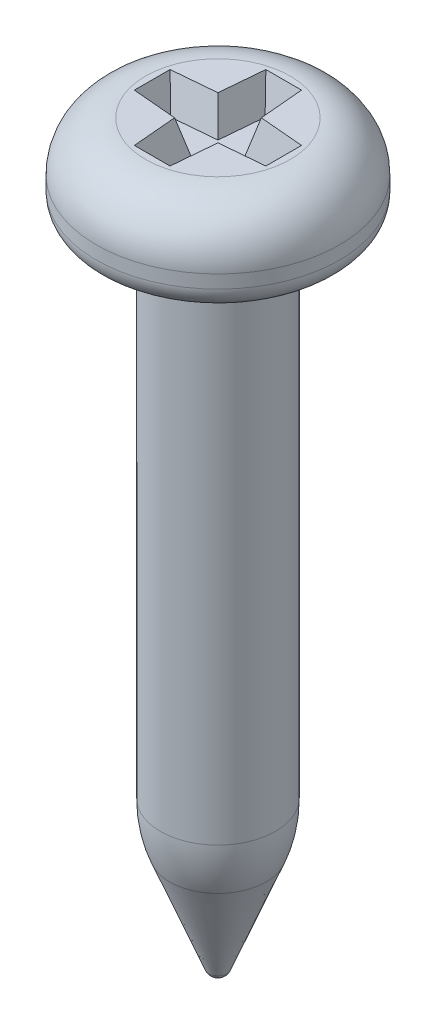
ISO-10303-21;
HEADER;
FILE_DESCRIPTION(('STEP AP214'),'2;1');
FILE_NAME('part.step','',(''),(''),'','','');
FILE_SCHEMA(('AUTOMOTIVE_DESIGN { 1 0 10303 214 1 1 1 1 }'));
ENDSEC;
DATA;
#1=APPLICATION_CONTEXT('core data for automotive mechanical design processes');
#2=APPLICATION_PROTOCOL_DEFINITION('international standard','automotive_design',2000,#1);
#3=PRODUCT_CONTEXT('',#1,'mechanical');
#4=PRODUCT('Part','Part','',(#3));
#5=PRODUCT_RELATED_PRODUCT_CATEGORY('part','',(#4));
#6=PRODUCT_DEFINITION_FORMATION('','',#4);
#7=PRODUCT_DEFINITION_CONTEXT('part definition',#1,'design');
#8=PRODUCT_DEFINITION('design','',#6,#7);
#9=PRODUCT_DEFINITION_SHAPE('','',#8);
#10=(LENGTH_UNIT() NAMED_UNIT(*) SI_UNIT(.MILLI.,.METRE.));
#11=(NAMED_UNIT(*) PLANE_ANGLE_UNIT() SI_UNIT($,.RADIAN.));
#12=(NAMED_UNIT(*) SI_UNIT($,.STERADIAN.) SOLID_ANGLE_UNIT());
#13=UNCERTAINTY_MEASURE_WITH_UNIT(LENGTH_MEASURE(1.E-05),#10,'distance_accuracy_value','');
#14=(GEOMETRIC_REPRESENTATION_CONTEXT(3) GLOBAL_UNCERTAINTY_ASSIGNED_CONTEXT((#13)) GLOBAL_UNIT_ASSIGNED_CONTEXT((#10,
#11,#12)) REPRESENTATION_CONTEXT('',''));
#15=CARTESIAN_POINT('',(0.,0.,0.));
#16=DIRECTION('',(0.,0.,1.));
#17=DIRECTION('',(1.,0.,0.));
#18=AXIS2_PLACEMENT_3D('',#15,#16,#17);
#19=CARTESIAN_POINT('',(1.1,0.,0.));
#20=DIRECTION('',(0.,-1.,0.));
#21=DIRECTION('',(1.,0.,0.));
#22=AXIS2_PLACEMENT_3D('',#19,#20,#21);
#23=PLANE('',#22);
#24=DIRECTION('',(-1.,0.,0.));
#25=VECTOR('',#24,1.);
#26=CARTESIAN_POINT('',(-0.271382595437633,0.,-1.));
#27=LINE('',#26,#25);
#28=CARTESIAN_POINT('',(0.271382595437633,0.,-1.));
#29=VERTEX_POINT('',#28);
#30=CARTESIAN_POINT('',(-0.271382595437633,0.,-1.));
#31=VERTEX_POINT('',#30);
#32=EDGE_CURVE('E139',#29,#31,#27,.T.);
#33=ORIENTED_EDGE('',*,*,#32,.F.);
#34=DIRECTION('',(-0.0871557427476548,0.,-0.996194698091746));
#35=VECTOR('',#34,1.);
#36=CARTESIAN_POINT('',(0.271382595437633,0.,-1.));
#37=LINE('',#36,#35);
#38=CARTESIAN_POINT('',(0.33,0.,-0.33));
#39=VERTEX_POINT('',#38);
#40=EDGE_CURVE('E47',#39,#29,#37,.T.);
#41=ORIENTED_EDGE('',*,*,#40,.F.);
#42=DIRECTION('',(-0.996194698091746,0.,-0.0871557427476548));
#43=VECTOR('',#42,1.);
#44=CARTESIAN_POINT('',(0.33,0.,-0.33));
#45=LINE('',#44,#43);
#46=CARTESIAN_POINT('',(1.,0.,-0.271382595437633));
#47=VERTEX_POINT('',#46);
#48=EDGE_CURVE('E171',#47,#39,#45,.T.);
#49=ORIENTED_EDGE('',*,*,#48,.F.);
#50=DIRECTION('',(0.,0.,-1.));
#51=VECTOR('',#50,1.);
#52=CARTESIAN_POINT('',(1.,0.,-0.271382595437633));
#53=LINE('',#52,#51);
#54=CARTESIAN_POINT('',(1.,0.,0.271382595437633));
#55=VERTEX_POINT('',#54);
#56=EDGE_CURVE('E169',#55,#47,#53,.T.);
#57=ORIENTED_EDGE('',*,*,#56,.F.);
#58=DIRECTION('',(0.996194698091746,0.,-0.0871557427476548));
#59=VECTOR('',#58,1.);
#60=CARTESIAN_POINT('',(0.33,0.,0.33));
#61=LINE('',#60,#59);
#62=CARTESIAN_POINT('',(0.33,0.,0.33));
#63=VERTEX_POINT('',#62);
#64=EDGE_CURVE('E166',#63,#55,#61,.T.);
#65=ORIENTED_EDGE('',*,*,#64,.F.);
#66=DIRECTION('',(0.0871557427476548,0.,-0.996194698091746));
#67=VECTOR('',#66,1.);
#68=CARTESIAN_POINT('',(0.271382595437633,0.,1.));
#69=LINE('',#68,#67);
#70=CARTESIAN_POINT('',(0.271382595437633,0.,1.));
#71=VERTEX_POINT('',#70);
#72=EDGE_CURVE('E163',#71,#63,#69,.T.);
#73=ORIENTED_EDGE('',*,*,#72,.F.);
#74=DIRECTION('',(1.,0.,0.));
#75=VECTOR('',#74,1.);
#76=CARTESIAN_POINT('',(-0.271382595437633,0.,1.));
#77=LINE('',#76,#75);
#78=CARTESIAN_POINT('',(-0.271382595437633,0.,1.));
#79=VERTEX_POINT('',#78);
#80=EDGE_CURVE('E160',#79,#71,#77,.T.);
#81=ORIENTED_EDGE('',*,*,#80,.F.);
#82=DIRECTION('',(0.0871557427476548,0.,0.996194698091746));
#83=VECTOR('',#82,1.);
#84=CARTESIAN_POINT('',(-0.271382595437633,0.,1.));
#85=LINE('',#84,#83);
#86=CARTESIAN_POINT('',(-0.33,0.,0.33));
#87=VERTEX_POINT('',#86);
#88=EDGE_CURVE('E157',#87,#79,#85,.T.);
#89=ORIENTED_EDGE('',*,*,#88,.F.);
#90=DIRECTION('',(0.996194698091746,0.,0.0871557427476548));
#91=VECTOR('',#90,1.);
#92=CARTESIAN_POINT('',(-0.33,0.,0.33));
#93=LINE('',#92,#91);
#94=CARTESIAN_POINT('',(-1.,0.,0.271382595437633));
#95=VERTEX_POINT('',#94);
#96=EDGE_CURVE('E154',#95,#87,#93,.T.);
#97=ORIENTED_EDGE('',*,*,#96,.F.);
#98=DIRECTION('',(0.,0.,1.));
#99=VECTOR('',#98,1.);
#100=CARTESIAN_POINT('',(-1.,0.,-0.271382595437633));
#101=LINE('',#100,#99);
#102=CARTESIAN_POINT('',(-1.,0.,-0.271382595437633));
#103=VERTEX_POINT('',#102);
#104=EDGE_CURVE('E148',#103,#95,#101,.T.);
#105=ORIENTED_EDGE('',*,*,#104,.F.);
#106=DIRECTION('',(-0.996194698091746,0.,0.0871557427476548));
#107=VECTOR('',#106,1.);
#108=CARTESIAN_POINT('',(-0.33,0.,-0.33));
#109=LINE('',#108,#107);
#110=CARTESIAN_POINT('',(-0.33,0.,-0.33));
#111=VERTEX_POINT('',#110);
#112=EDGE_CURVE('E146',#111,#103,#109,.T.);
#113=ORIENTED_EDGE('',*,*,#112,.F.);
#114=DIRECTION('',(-0.0871557427476548,0.,0.996194698091746));
#115=VECTOR('',#114,1.);
#116=CARTESIAN_POINT('',(-0.271382595437633,0.,-1.));
#117=LINE('',#116,#115);
#118=EDGE_CURVE('E130',#31,#111,#117,.T.);
#119=ORIENTED_EDGE('',*,*,#118,.F.);
#120=EDGE_LOOP('',(#33,#41,#49,#57,#65,#73,#81,#89,#97,#105,#113,#119));
#121=FACE_BOUND('',#120,.T.);
#122=CARTESIAN_POINT('',(0.,0.,0.));
#123=DIRECTION('',(0.,1.,0.));
#124=DIRECTION('',(-1.,0.,0.));
#125=AXIS2_PLACEMENT_3D('',#122,#123,#124);
#126=CIRCLE('',#125,1.1);
#127=CARTESIAN_POINT('',(-1.1,0.,0.));
#128=VERTEX_POINT('',#127);
#129=EDGE_CURVE('E11',#128,#128,#126,.T.);
#130=ORIENTED_EDGE('',*,*,#129,.T.);
#131=EDGE_LOOP('',(#130));
#132=FACE_BOUND('',#131,.T.);
#133=ADVANCED_FACE('F33',(#121,#132),#23,.F.);
#134=CARTESIAN_POINT('',(0.,-0.75,0.));
#135=DIRECTION('',(0.,1.,0.));
#136=DIRECTION('',(-1.,0.,0.));
#137=AXIS2_PLACEMENT_3D('',#134,#135,#136);
#138=TOROIDAL_SURFACE('',#137,1.1,0.75);
#139=ORIENTED_EDGE('',*,*,#129,.F.);
#140=EDGE_LOOP('',(#139));
#141=FACE_BOUND('',#140,.T.);
#142=CARTESIAN_POINT('',(0.,-0.75,0.));
#143=DIRECTION('',(0.,1.,0.));
#144=DIRECTION('',(-1.,0.,0.));
#145=AXIS2_PLACEMENT_3D('',#142,#143,#144);
#146=CIRCLE('',#145,1.85);
#147=CARTESIAN_POINT('',(-1.85,-0.75,0.));
#148=VERTEX_POINT('',#147);
#149=EDGE_CURVE('E40',#148,#148,#146,.T.);
#150=ORIENTED_EDGE('',*,*,#149,.T.);
#151=EDGE_LOOP('',(#150));
#152=FACE_BOUND('',#151,.T.);
#153=ADVANCED_FACE('F247',(#141,#152),#138,.T.);
#154=CARTESIAN_POINT('',(0.,0.,0.));
#155=DIRECTION('',(0.,1.,0.));
#156=DIRECTION('',(-1.,0.,0.));
#157=AXIS2_PLACEMENT_3D('',#154,#155,#156);
#158=CYLINDRICAL_SURFACE('',#157,1.85);
#159=ORIENTED_EDGE('',*,*,#149,.F.);
#160=EDGE_LOOP('',(#159));
#161=FACE_BOUND('',#160,.T.);
#162=CARTESIAN_POINT('',(0.,-0.95,0.));
#163=DIRECTION('',(0.,1.,0.));
#164=DIRECTION('',(-1.,0.,0.));
#165=AXIS2_PLACEMENT_3D('',#162,#163,#164);
#166=CIRCLE('',#165,1.85);
#167=CARTESIAN_POINT('',(-1.85,-0.95,0.));
#168=VERTEX_POINT('',#167);
#169=EDGE_CURVE('E242',#168,#168,#166,.T.);
#170=ORIENTED_EDGE('',*,*,#169,.T.);
#171=EDGE_LOOP('',(#170));
#172=FACE_BOUND('',#171,.T.);
#173=ADVANCED_FACE('F249',(#161,#172),#158,.T.);
#174=CARTESIAN_POINT('',(0.,-0.95,0.));
#175=DIRECTION('',(0.,1.,0.));
#176=DIRECTION('',(-1.,0.,0.));
#177=AXIS2_PLACEMENT_3D('',#174,#175,#176);
#178=TOROIDAL_SURFACE('',#177,1.5,0.35);
#179=ORIENTED_EDGE('',*,*,#169,.F.);
#180=EDGE_LOOP('',(#179));
#181=FACE_BOUND('',#180,.T.);
#182=CARTESIAN_POINT('',(0.,-1.3,0.));
#183=DIRECTION('',(0.,1.,0.));
#184=DIRECTION('',(-1.,0.,0.));
#185=AXIS2_PLACEMENT_3D('',#182,#183,#184);
#186=CIRCLE('',#185,1.5);
#187=CARTESIAN_POINT('',(-1.5,-1.3,0.));
#188=VERTEX_POINT('',#187);
#189=EDGE_CURVE('E239',#188,#188,#186,.T.);
#190=ORIENTED_EDGE('',*,*,#189,.T.);
#191=EDGE_LOOP('',(#190));
#192=FACE_BOUND('',#191,.T.);
#193=ADVANCED_FACE('F252',(#181,#192),#178,.T.);
#194=CARTESIAN_POINT('',(1.025,-1.3,0.));
#195=DIRECTION('',(0.,1.,0.));
#196=DIRECTION('',(-1.,0.,0.));
#197=AXIS2_PLACEMENT_3D('',#194,#195,#196);
#198=PLANE('',#197);
#199=ORIENTED_EDGE('',*,*,#189,.F.);
#200=EDGE_LOOP('',(#199));
#201=FACE_BOUND('',#200,.T.);
#202=CARTESIAN_POINT('',(0.,-1.3,0.));
#203=DIRECTION('',(0.,1.,0.));
#204=DIRECTION('',(-1.,0.,0.));
#205=AXIS2_PLACEMENT_3D('',#202,#203,#204);
#206=CIRCLE('',#205,1.025);
#207=CARTESIAN_POINT('',(-1.025,-1.3,0.));
#208=VERTEX_POINT('',#207);
#209=EDGE_CURVE('E236',#208,#208,#206,.T.);
#210=ORIENTED_EDGE('',*,*,#209,.T.);
#211=EDGE_LOOP('',(#210));
#212=FACE_BOUND('',#211,.T.);
#213=ADVANCED_FACE('F258',(#201,#212),#198,.F.);
#214=CARTESIAN_POINT('',(0.,-1.45,0.));
#215=DIRECTION('',(0.,1.,0.));
#216=DIRECTION('',(-1.,0.,0.));
#217=AXIS2_PLACEMENT_3D('',#214,#215,#216);
#218=TOROIDAL_SURFACE('',#217,1.025,0.15);
#219=ORIENTED_EDGE('',*,*,#209,.F.);
#220=EDGE_LOOP('',(#219));
#221=FACE_BOUND('',#220,.T.);
#222=CARTESIAN_POINT('',(0.,-1.45,0.));
#223=DIRECTION('',(0.,1.,0.));
#224=DIRECTION('',(-1.,0.,0.));
#225=AXIS2_PLACEMENT_3D('',#222,#223,#224);
#226=CIRCLE('',#225,0.875);
#227=CARTESIAN_POINT('',(-0.874999999999999,-1.45,0.));
#228=VERTEX_POINT('',#227);
#229=EDGE_CURVE('E233',#228,#228,#226,.T.);
#230=ORIENTED_EDGE('',*,*,#229,.T.);
#231=EDGE_LOOP('',(#230));
#232=FACE_BOUND('',#231,.T.);
#233=ADVANCED_FACE('F264',(#221,#232),#218,.F.);
#234=CARTESIAN_POINT('',(0.,0.,0.));
#235=DIRECTION('',(0.,1.,0.));
#236=DIRECTION('',(-1.,0.,0.));
#237=AXIS2_PLACEMENT_3D('',#234,#235,#236);
#238=CYLINDRICAL_SURFACE('',#237,0.875);
#239=ORIENTED_EDGE('',*,*,#229,.F.);
#240=EDGE_LOOP('',(#239));
#241=FACE_BOUND('',#240,.T.);
#242=CARTESIAN_POINT('',(0.,-8.96440542344636,0.));
#243=DIRECTION('',(0.,1.,0.));
#244=DIRECTION('',(-1.,0.,0.));
#245=AXIS2_PLACEMENT_3D('',#242,#243,#244);
#246=CIRCLE('',#245,0.875);
#247=CARTESIAN_POINT('',(-0.874999999999999,-8.96440542344636,0.));
#248=VERTEX_POINT('',#247);
#249=EDGE_CURVE('E230',#248,#248,#246,.T.);
#250=ORIENTED_EDGE('',*,*,#249,.T.);
#251=EDGE_LOOP('',(#250));
#252=FACE_BOUND('',#251,.T.);
#253=ADVANCED_FACE('F270',(#241,#252),#238,.T.);
#254=CARTESIAN_POINT('',(0.,-8.96440542344636,0.));
#255=DIRECTION('',(0.,1.,0.));
#256=DIRECTION('',(-1.,0.,0.));
#257=AXIS2_PLACEMENT_3D('',#254,#255,#256);
#258=DEGENERATE_TOROIDAL_SURFACE('',#257,1.125,2.,.F.);
#259=ORIENTED_EDGE('',*,*,#249,.F.);
#260=EDGE_LOOP('',(#259));
#261=FACE_BOUND('',#260,.T.);
#262=CARTESIAN_POINT('',(0.,-9.7,0.));
#263=DIRECTION('',(0.,1.,0.));
#264=DIRECTION('',(-1.,0.,0.));
#265=AXIS2_PLACEMENT_3D('',#262,#263,#264);
#266=CIRCLE('',#265,0.73481198483741);
#267=CARTESIAN_POINT('',(-0.734811984837409,-9.7,0.));
#268=VERTEX_POINT('',#267);
#269=EDGE_CURVE('E227',#268,#268,#266,.T.);
#270=ORIENTED_EDGE('',*,*,#269,.T.);
#271=EDGE_LOOP('',(#270));
#272=FACE_BOUND('',#271,.T.);
#273=ADVANCED_FACE('F276',(#261,#272),#258,.F.);
#274=CARTESIAN_POINT('',(0.,-11.2051695932415,0.));
#275=DIRECTION('',(0.,1.,0.));
#276=DIRECTION('',(-1.,0.,0.));
#277=AXIS2_PLACEMENT_3D('',#274,#275,#276);
#278=CONICAL_SURFACE('',#277,0.139485898862805,0.376639161138822);
#279=ORIENTED_EDGE('',*,*,#269,.F.);
#280=EDGE_LOOP('',(#279));
#281=FACE_BOUND('',#280,.T.);
#282=CARTESIAN_POINT('',(0.,-11.2051695932415,0.));
#283=DIRECTION('',(0.,1.,0.));
#284=DIRECTION('',(-1.,0.,0.));
#285=AXIS2_PLACEMENT_3D('',#282,#283,#284);
#286=CIRCLE('',#285,0.139485898862805);
#287=CARTESIAN_POINT('',(-0.139485898862804,-11.2051695932415,0.));
#288=VERTEX_POINT('',#287);
#289=EDGE_CURVE('E175',#288,#288,#286,.T.);
#290=ORIENTED_EDGE('',*,*,#289,.T.);
#291=EDGE_LOOP('',(#290));
#292=FACE_BOUND('',#291,.T.);
#293=ADVANCED_FACE('F282',(#281,#292),#278,.T.);
#294=CARTESIAN_POINT('',(0.,-11.15,0.));
#295=DIRECTION('',(0.,1.,0.));
#296=DIRECTION('',(-1.,0.,0.));
#297=AXIS2_PLACEMENT_3D('',#294,#295,#296);
#298=SPHERICAL_SURFACE('',#297,0.149999999999999);
#299=ORIENTED_EDGE('',*,*,#289,.F.);
#300=EDGE_LOOP('',(#299));
#301=FACE_BOUND('',#300,.T.);
#302=ADVANCED_FACE('F288',(#301),#298,.T.);
#303=CARTESIAN_POINT('',(0.271382595437633,0.,-1.));
#304=DIRECTION('',(0.962250186899058,-0.258819045102521,-0.0841859828293659));
#305=DIRECTION('',(0.259741110692871,0.965678287741851,0.));
#306=AXIS2_PLACEMENT_3D('',#303,#304,#305);
#307=PLANE('',#306);
#308=ORIENTED_EDGE('',*,*,#40,.T.);
#309=DIRECTION('',(0.230762906723662,0.939855498552101,-0.251833521838986));
#310=VECTOR('',#309,1.);
#311=CARTESIAN_POINT('',(0.271382595437633,0.,-1.));
#312=LINE('',#311,#310);
#313=CARTESIAN_POINT('',(0.148617496398917,-0.5,-0.866025403784438));
#314=VERTEX_POINT('',#313);
#315=EDGE_CURVE('E90',#314,#29,#312,.T.);
#316=ORIENTED_EDGE('',*,*,#315,.F.);
#317=DIRECTION('',(-0.0871557427476548,0.,-0.996194698091746));
#318=VECTOR('',#317,1.);
#319=CARTESIAN_POINT('',(0.222680446133132,-0.5,-0.0194820146255435));
#320=LINE('',#319,#318);
#321=CARTESIAN_POINT('',(0.206333094846248,-0.5,-0.206333094846248));
#322=VERTEX_POINT('',#321);
#323=EDGE_CURVE('E173',#322,#314,#320,.T.);
#324=ORIENTED_EDGE('',*,*,#323,.F.);
#325=DIRECTION('',(0.233463888260859,0.943922256203466,-0.233463888260859));
#326=VECTOR('',#325,1.);
#327=CARTESIAN_POINT('',(0.363323645043907,0.134731458681192,-0.363323645043907));
#328=LINE('',#327,#326);
#329=EDGE_CURVE('E55',#322,#39,#328,.T.);
#330=ORIENTED_EDGE('',*,*,#329,.T.);
#331=EDGE_LOOP('',(#308,#316,#324,#330));
#332=FACE_BOUND('',#331,.T.);
#333=ADVANCED_FACE('F293',(#332),#307,.F.);
#334=CARTESIAN_POINT('',(0.33,0.,-0.33));
#335=DIRECTION('',(0.0841859828293659,-0.258819045102521,-0.962250186899058));
#336=DIRECTION('',(0.,0.965678287741851,-0.259741110692871));
#337=AXIS2_PLACEMENT_3D('',#334,#335,#336);
#338=PLANE('',#337);
#339=ORIENTED_EDGE('',*,*,#48,.T.);
#340=ORIENTED_EDGE('',*,*,#329,.F.);
#341=DIRECTION('',(-0.996194698091746,0.,-0.0871557427476548));
#342=VECTOR('',#341,1.);
#343=CARTESIAN_POINT('',(0.0194820146255435,-0.5,-0.222680446133132));
#344=LINE('',#343,#342);
#345=CARTESIAN_POINT('',(0.866025403784438,-0.5,-0.148617496398917));
#346=VERTEX_POINT('',#345);
#347=EDGE_CURVE('E176',#346,#322,#344,.T.);
#348=ORIENTED_EDGE('',*,*,#347,.F.);
#349=DIRECTION('',(0.251833521838986,0.939855498552101,-0.230762906723662));
#350=VECTOR('',#349,1.);
#351=CARTESIAN_POINT('',(1.,0.,-0.271382595437633));
#352=LINE('',#351,#350);
#353=EDGE_CURVE('E95',#346,#47,#352,.T.);
#354=ORIENTED_EDGE('',*,*,#353,.T.);
#355=EDGE_LOOP('',(#339,#340,#348,#354));
#356=FACE_BOUND('',#355,.T.);
#357=ADVANCED_FACE('F298',(#356),#338,.F.);
#358=CARTESIAN_POINT('',(1.,0.,-0.271382595437633));
#359=DIRECTION('',(0.965925826289068,-0.258819045102521,0.));
#360=DIRECTION('',(0.258819045102521,0.965925826289068,0.));
#361=AXIS2_PLACEMENT_3D('',#358,#359,#360);
#362=PLANE('',#361);
#363=ORIENTED_EDGE('',*,*,#56,.T.);
#364=ORIENTED_EDGE('',*,*,#353,.F.);
#365=DIRECTION('',(0.,0.,-1.));
#366=VECTOR('',#365,1.);
#367=CARTESIAN_POINT('',(0.866025403784438,-0.5,0.));
#368=LINE('',#367,#366);
#369=CARTESIAN_POINT('',(0.866025403784438,-0.5,0.148617496398917));
#370=VERTEX_POINT('',#369);
#371=EDGE_CURVE('E199',#370,#346,#368,.T.);
#372=ORIENTED_EDGE('',*,*,#371,.F.);
#373=DIRECTION('',(0.251833521838986,0.939855498552101,0.230762906723662));
#374=VECTOR('',#373,1.);
#375=CARTESIAN_POINT('',(0.960914999983138,-0.145867205876761,0.23556779148571));
#376=LINE('',#375,#374);
#377=EDGE_CURVE('E191',#370,#55,#376,.T.);
#378=ORIENTED_EDGE('',*,*,#377,.T.);
#379=EDGE_LOOP('',(#363,#364,#372,#378));
#380=FACE_BOUND('',#379,.T.);
#381=ADVANCED_FACE('F360',(#380),#362,.F.);
#382=CARTESIAN_POINT('',(0.33,0.,0.33));
#383=DIRECTION('',(0.0841859828293659,-0.258819045102521,0.962250186899058));
#384=DIRECTION('',(0.,-0.965678287741851,-0.259741110692871));
#385=AXIS2_PLACEMENT_3D('',#382,#383,#384);
#386=PLANE('',#385);
#387=ORIENTED_EDGE('',*,*,#64,.T.);
#388=ORIENTED_EDGE('',*,*,#377,.F.);
#389=DIRECTION('',(0.996194698091746,0.,-0.0871557427476548));
#390=VECTOR('',#389,1.);
#391=CARTESIAN_POINT('',(0.0194820146255435,-0.5,0.222680446133132));
#392=LINE('',#391,#390);
#393=CARTESIAN_POINT('',(0.206333094846248,-0.5,0.206333094846248));
#394=VERTEX_POINT('',#393);
#395=EDGE_CURVE('E202',#394,#370,#392,.T.);
#396=ORIENTED_EDGE('',*,*,#395,.F.);
#397=DIRECTION('',(0.233463888260859,0.943922256203466,0.233463888260859));
#398=VECTOR('',#397,1.);
#399=CARTESIAN_POINT('',(0.33,0.,0.33));
#400=LINE('',#399,#398);
#401=EDGE_CURVE('E189',#394,#63,#400,.T.);
#402=ORIENTED_EDGE('',*,*,#401,.T.);
#403=EDGE_LOOP('',(#387,#388,#396,#402));
#404=FACE_BOUND('',#403,.T.);
#405=ADVANCED_FACE('F368',(#404),#386,.F.);
#406=CARTESIAN_POINT('',(0.271382595437633,0.,1.));
#407=DIRECTION('',(0.962250186899058,-0.258819045102521,0.0841859828293659));
#408=DIRECTION('',(0.259741110692871,0.965678287741851,0.));
#409=AXIS2_PLACEMENT_3D('',#406,#407,#408);
#410=PLANE('',#409);
#411=ORIENTED_EDGE('',*,*,#72,.T.);
#412=ORIENTED_EDGE('',*,*,#401,.F.);
#413=DIRECTION('',(0.0871557427476548,0.,-0.996194698091746));
#414=VECTOR('',#413,1.);
#415=CARTESIAN_POINT('',(0.222680446133132,-0.5,0.0194820146255435));
#416=LINE('',#415,#414);
#417=CARTESIAN_POINT('',(0.148617496398917,-0.5,0.866025403784438));
#418=VERTEX_POINT('',#417);
#419=EDGE_CURVE('E205',#418,#394,#416,.T.);
#420=ORIENTED_EDGE('',*,*,#419,.F.);
#421=DIRECTION('',(0.230762906723662,0.939855498552101,0.251833521838986));
#422=VECTOR('',#421,1.);
#423=CARTESIAN_POINT('',(0.242479524498311,-0.117716969910997,0.968457832976909));
#424=LINE('',#423,#422);
#425=EDGE_CURVE('E187',#418,#71,#424,.T.);
#426=ORIENTED_EDGE('',*,*,#425,.T.);
#427=EDGE_LOOP('',(#411,#412,#420,#426));
#428=FACE_BOUND('',#427,.T.);
#429=ADVANCED_FACE('F378',(#428),#410,.F.);
#430=CARTESIAN_POINT('',(-0.271382595437633,0.,1.));
#431=DIRECTION('',(0.,-0.258819045102521,0.965925826289068));
#432=DIRECTION('',(0.,-0.965925826289068,-0.258819045102521));
#433=AXIS2_PLACEMENT_3D('',#430,#431,#432);
#434=PLANE('',#433);
#435=ORIENTED_EDGE('',*,*,#80,.T.);
#436=ORIENTED_EDGE('',*,*,#425,.F.);
#437=DIRECTION('',(1.,0.,0.));
#438=VECTOR('',#437,1.);
#439=CARTESIAN_POINT('',(0.,-0.5,0.866025403784438));
#440=LINE('',#439,#438);
#441=CARTESIAN_POINT('',(-0.148617496398917,-0.5,0.866025403784438));
#442=VERTEX_POINT('',#441);
#443=EDGE_CURVE('E208',#442,#418,#440,.T.);
#444=ORIENTED_EDGE('',*,*,#443,.F.);
#445=DIRECTION('',(-0.230762906723662,0.939855498552101,0.251833521838986));
#446=VECTOR('',#445,1.);
#447=CARTESIAN_POINT('',(-0.271382595437633,0.,1.));
#448=LINE('',#447,#446);
#449=EDGE_CURVE('E185',#442,#79,#448,.T.);
#450=ORIENTED_EDGE('',*,*,#449,.T.);
#451=EDGE_LOOP('',(#435,#436,#444,#450));
#452=FACE_BOUND('',#451,.T.);
#453=ADVANCED_FACE('F388',(#452),#434,.F.);
#454=CARTESIAN_POINT('',(-0.271382595437633,0.,1.));
#455=DIRECTION('',(-0.962250186899058,-0.258819045102521,0.0841859828293659));
#456=DIRECTION('',(0.259741110692871,-0.965678287741851,0.));
#457=AXIS2_PLACEMENT_3D('',#454,#455,#456);
#458=PLANE('',#457);
#459=ORIENTED_EDGE('',*,*,#88,.T.);
#460=ORIENTED_EDGE('',*,*,#449,.F.);
#461=DIRECTION('',(0.0871557427476548,0.,0.996194698091746));
#462=VECTOR('',#461,1.);
#463=CARTESIAN_POINT('',(-0.222680446133132,-0.5,0.0194820146255435));
#464=LINE('',#463,#462);
#465=CARTESIAN_POINT('',(-0.206333094846248,-0.5,0.206333094846248));
#466=VERTEX_POINT('',#465);
#467=EDGE_CURVE('E211',#466,#442,#464,.T.);
#468=ORIENTED_EDGE('',*,*,#467,.F.);
#469=DIRECTION('',(-0.23346388826086,0.943922256203466,0.233463888260859));
#470=VECTOR('',#469,1.);
#471=CARTESIAN_POINT('',(-0.363323645043907,0.134731458681192,0.363323645043907));
#472=LINE('',#471,#470);
#473=EDGE_CURVE('E183',#466,#87,#472,.T.);
#474=ORIENTED_EDGE('',*,*,#473,.T.);
#475=EDGE_LOOP('',(#459,#460,#468,#474));
#476=FACE_BOUND('',#475,.T.);
#477=ADVANCED_FACE('F398',(#476),#458,.F.);
#478=CARTESIAN_POINT('',(-0.33,0.,0.33));
#479=DIRECTION('',(-0.0841859828293659,-0.258819045102521,0.962250186899058));
#480=DIRECTION('',(0.,-0.965678287741851,-0.259741110692871));
#481=AXIS2_PLACEMENT_3D('',#478,#479,#480);
#482=PLANE('',#481);
#483=ORIENTED_EDGE('',*,*,#96,.T.);
#484=ORIENTED_EDGE('',*,*,#473,.F.);
#485=DIRECTION('',(0.996194698091746,0.,0.0871557427476548));
#486=VECTOR('',#485,1.);
#487=CARTESIAN_POINT('',(-0.0194820146255434,-0.5,0.222680446133132));
#488=LINE('',#487,#486);
#489=CARTESIAN_POINT('',(-0.866025403784438,-0.5,0.148617496398917));
#490=VERTEX_POINT('',#489);
#491=EDGE_CURVE('E214',#490,#466,#488,.T.);
#492=ORIENTED_EDGE('',*,*,#491,.F.);
#493=DIRECTION('',(-0.251833521838987,0.939855498552101,0.230762906723662));
#494=VECTOR('',#493,1.);
#495=CARTESIAN_POINT('',(-0.968457832976909,-0.117716969910997,0.242479524498311));
#496=LINE('',#495,#494);
#497=EDGE_CURVE('E181',#490,#95,#496,.T.);
#498=ORIENTED_EDGE('',*,*,#497,.T.);
#499=EDGE_LOOP('',(#483,#484,#492,#498));
#500=FACE_BOUND('',#499,.T.);
#501=ADVANCED_FACE('F408',(#500),#482,.F.);
#502=CARTESIAN_POINT('',(-1.,0.,-0.271382595437633));
#503=DIRECTION('',(-0.965925826289068,-0.258819045102521,0.));
#504=DIRECTION('',(0.258819045102522,-0.965925826289068,0.));
#505=AXIS2_PLACEMENT_3D('',#502,#503,#504);
#506=PLANE('',#505);
#507=ORIENTED_EDGE('',*,*,#104,.T.);
#508=ORIENTED_EDGE('',*,*,#497,.F.);
#509=DIRECTION('',(0.,0.,1.));
#510=VECTOR('',#509,1.);
#511=CARTESIAN_POINT('',(-0.866025403784438,-0.5,0.));
#512=LINE('',#511,#510);
#513=CARTESIAN_POINT('',(-0.866025403784438,-0.5,-0.148617496398917));
#514=VERTEX_POINT('',#513);
#515=EDGE_CURVE('E217',#514,#490,#512,.T.);
#516=ORIENTED_EDGE('',*,*,#515,.F.);
#517=DIRECTION('',(-0.251833521838987,0.939855498552101,-0.230762906723662));
#518=VECTOR('',#517,1.);
#519=CARTESIAN_POINT('',(-0.960914999983137,-0.145867205876761,-0.23556779148571));
#520=LINE('',#519,#518);
#521=EDGE_CURVE('E179',#514,#103,#520,.T.);
#522=ORIENTED_EDGE('',*,*,#521,.T.);
#523=EDGE_LOOP('',(#507,#508,#516,#522));
#524=FACE_BOUND('',#523,.T.);
#525=ADVANCED_FACE('F418',(#524),#506,.F.);
#526=CARTESIAN_POINT('',(-0.33,0.,-0.33));
#527=DIRECTION('',(-0.0841859828293659,-0.258819045102521,-0.962250186899058));
#528=DIRECTION('',(0.,0.965678287741851,-0.259741110692871));
#529=AXIS2_PLACEMENT_3D('',#526,#527,#528);
#530=PLANE('',#529);
#531=ORIENTED_EDGE('',*,*,#112,.T.);
#532=ORIENTED_EDGE('',*,*,#521,.F.);
#533=DIRECTION('',(-0.996194698091746,0.,0.0871557427476548));
#534=VECTOR('',#533,1.);
#535=CARTESIAN_POINT('',(-0.0194820146255434,-0.5,-0.222680446133132));
#536=LINE('',#535,#534);
#537=CARTESIAN_POINT('',(-0.206333094846248,-0.5,-0.206333094846248));
#538=VERTEX_POINT('',#537);
#539=EDGE_CURVE('E220',#538,#514,#536,.T.);
#540=ORIENTED_EDGE('',*,*,#539,.F.);
#541=DIRECTION('',(-0.23346388826086,0.943922256203466,-0.233463888260859));
#542=VECTOR('',#541,1.);
#543=CARTESIAN_POINT('',(-0.33,0.,-0.33));
#544=LINE('',#543,#542);
#545=EDGE_CURVE('E136',#538,#111,#544,.T.);
#546=ORIENTED_EDGE('',*,*,#545,.T.);
#547=EDGE_LOOP('',(#531,#532,#540,#546));
#548=FACE_BOUND('',#547,.T.);
#549=ADVANCED_FACE('F428',(#548),#530,.F.);
#550=CARTESIAN_POINT('',(-0.271382595437633,0.,-1.));
#551=DIRECTION('',(-0.962250186899058,-0.258819045102521,-0.0841859828293659));
#552=DIRECTION('',(0.259741110692871,-0.965678287741851,0.));
#553=AXIS2_PLACEMENT_3D('',#550,#551,#552);
#554=PLANE('',#553);
#555=ORIENTED_EDGE('',*,*,#118,.T.);
#556=ORIENTED_EDGE('',*,*,#545,.F.);
#557=DIRECTION('',(-0.0871557427476548,0.,0.996194698091746));
#558=VECTOR('',#557,1.);
#559=CARTESIAN_POINT('',(-0.222680446133132,-0.5,-0.0194820146255435));
#560=LINE('',#559,#558);
#561=CARTESIAN_POINT('',(-0.148617496398917,-0.5,-0.866025403784438));
#562=VERTEX_POINT('',#561);
#563=EDGE_CURVE('E133',#562,#538,#560,.T.);
#564=ORIENTED_EDGE('',*,*,#563,.F.);
#565=DIRECTION('',(-0.230762906723662,0.939855498552101,-0.251833521838986));
#566=VECTOR('',#565,1.);
#567=CARTESIAN_POINT('',(-0.271382595437633,0.,-1.));
#568=LINE('',#567,#566);
#569=EDGE_CURVE('E126',#562,#31,#568,.T.);
#570=ORIENTED_EDGE('',*,*,#569,.T.);
#571=EDGE_LOOP('',(#555,#556,#564,#570));
#572=FACE_BOUND('',#571,.T.);
#573=ADVANCED_FACE('F128',(#572),#554,.F.);
#574=CARTESIAN_POINT('',(-0.271382595437633,0.,-1.));
#575=DIRECTION('',(0.,-0.258819045102521,-0.965925826289068));
#576=DIRECTION('',(0.,0.965925826289068,-0.258819045102521));
#577=AXIS2_PLACEMENT_3D('',#574,#575,#576);
#578=PLANE('',#577);
#579=ORIENTED_EDGE('',*,*,#32,.T.);
#580=ORIENTED_EDGE('',*,*,#569,.F.);
#581=DIRECTION('',(-1.,0.,0.));
#582=VECTOR('',#581,1.);
#583=CARTESIAN_POINT('',(0.,-0.5,-0.866025403784438));
#584=LINE('',#583,#582);
#585=EDGE_CURVE('E196',#314,#562,#584,.T.);
#586=ORIENTED_EDGE('',*,*,#585,.F.);
#587=ORIENTED_EDGE('',*,*,#315,.T.);
#588=EDGE_LOOP('',(#579,#580,#586,#587));
#589=FACE_BOUND('',#588,.T.);
#590=ADVANCED_FACE('F140',(#589),#578,.F.);
#591=CARTESIAN_POINT('',(0.,-0.5,0.));
#592=DIRECTION('',(0.,1.,0.));
#593=DIRECTION('',(-1.,0.,0.));
#594=AXIS2_PLACEMENT_3D('',#591,#592,#593);
#595=PLANE('',#594);
#596=ORIENTED_EDGE('',*,*,#323,.T.);
#597=ORIENTED_EDGE('',*,*,#585,.T.);
#598=ORIENTED_EDGE('',*,*,#563,.T.);
#599=ORIENTED_EDGE('',*,*,#539,.T.);
#600=ORIENTED_EDGE('',*,*,#515,.T.);
#601=ORIENTED_EDGE('',*,*,#491,.T.);
#602=ORIENTED_EDGE('',*,*,#467,.T.);
#603=ORIENTED_EDGE('',*,*,#443,.T.);
#604=ORIENTED_EDGE('',*,*,#419,.T.);
#605=ORIENTED_EDGE('',*,*,#395,.T.);
#606=ORIENTED_EDGE('',*,*,#371,.T.);
#607=ORIENTED_EDGE('',*,*,#347,.T.);
#608=EDGE_LOOP('',(#596,#597,#598,#599,#600,#601,#602,#603,#604,#605,#606,#607));
#609=FACE_BOUND('',#608,.T.);
#610=ADVANCED_FACE('F455',(#609),#595,.T.);
#611=CLOSED_SHELL('',(#133,#153,#173,#193,#213,#233,#253,#273,#293,#302,#333,#357,#381,#405,
#429,#453,#477,#501,#525,#549,#573,#590,#610));
#612=MANIFOLD_SOLID_BREP('B2',#611);
#613=ADVANCED_BREP_SHAPE_REPRESENTATION('',(#18,#612),#14);
#614=SHAPE_DEFINITION_REPRESENTATION(#9,#613);
ENDSEC;
END-ISO-10303-21;
